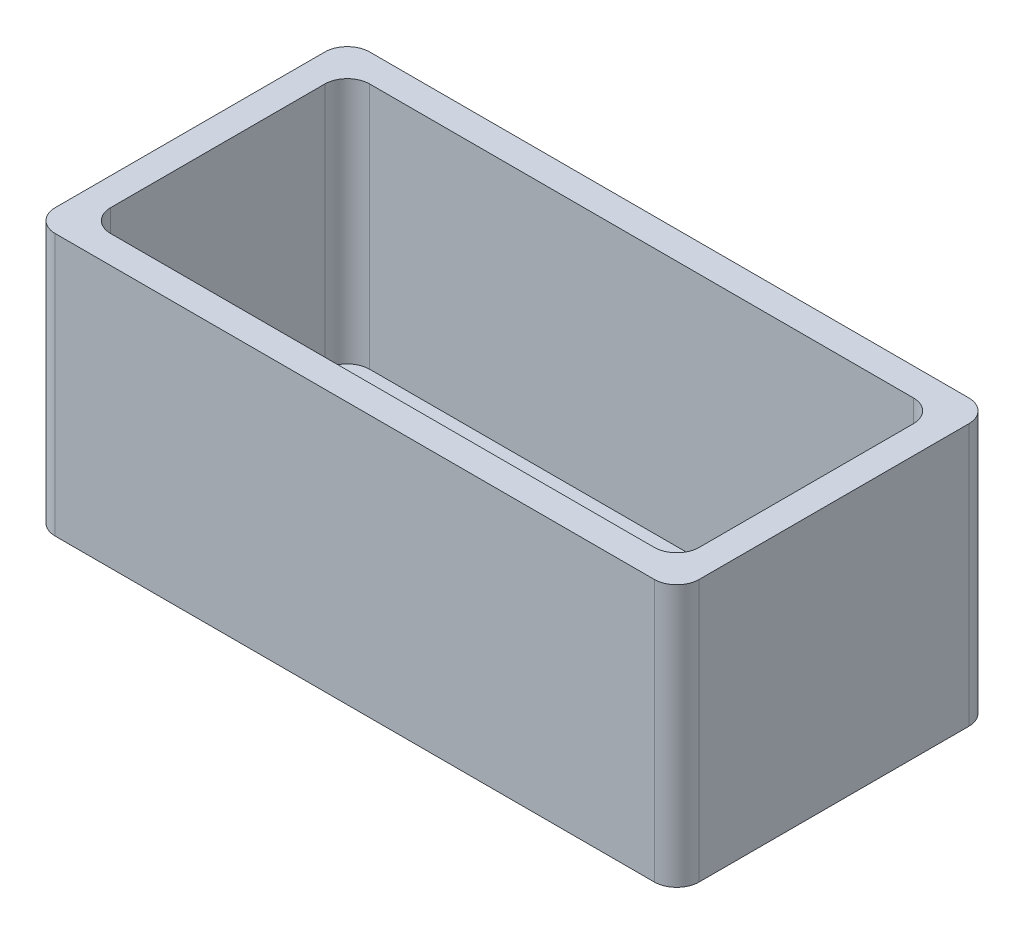
ISO-10303-21;
HEADER;
FILE_DESCRIPTION(('STEP AP214'),'2;1');
FILE_NAME('part.step','',(''),(''),'','','');
FILE_SCHEMA(('AUTOMOTIVE_DESIGN { 1 0 10303 214 1 1 1 1 }'));
ENDSEC;
DATA;
#1=APPLICATION_CONTEXT('core data for automotive mechanical design processes');
#2=APPLICATION_PROTOCOL_DEFINITION('international standard','automotive_design',2000,#1);
#3=PRODUCT_CONTEXT('',#1,'mechanical');
#4=PRODUCT('Part','Part','',(#3));
#5=PRODUCT_RELATED_PRODUCT_CATEGORY('part','',(#4));
#6=PRODUCT_DEFINITION_FORMATION('','',#4);
#7=PRODUCT_DEFINITION_CONTEXT('part definition',#1,'design');
#8=PRODUCT_DEFINITION('design','',#6,#7);
#9=PRODUCT_DEFINITION_SHAPE('','',#8);
#10=(LENGTH_UNIT() NAMED_UNIT(*) SI_UNIT(.MILLI.,.METRE.));
#11=(NAMED_UNIT(*) PLANE_ANGLE_UNIT() SI_UNIT($,.RADIAN.));
#12=(NAMED_UNIT(*) SI_UNIT($,.STERADIAN.) SOLID_ANGLE_UNIT());
#13=UNCERTAINTY_MEASURE_WITH_UNIT(LENGTH_MEASURE(1.E-05),#10,'distance_accuracy_value','');
#14=(GEOMETRIC_REPRESENTATION_CONTEXT(3) GLOBAL_UNCERTAINTY_ASSIGNED_CONTEXT((#13)) GLOBAL_UNIT_ASSIGNED_CONTEXT((#10,
#11,#12)) REPRESENTATION_CONTEXT('',''));
#15=CARTESIAN_POINT('',(0.,0.,0.));
#16=DIRECTION('',(0.,0.,1.));
#17=DIRECTION('',(1.,0.,0.));
#18=AXIS2_PLACEMENT_3D('',#15,#16,#17);
#19=CARTESIAN_POINT('',(0.,35.,0.));
#20=DIRECTION('',(0.,-1.,0.));
#21=DIRECTION('',(0.,0.,-1.));
#22=AXIS2_PLACEMENT_3D('',#19,#20,#21);
#23=PLANE('',#22);
#24=CARTESIAN_POINT('',(79.3,35.,-6.7));
#25=DIRECTION('',(0.,1.,0.));
#26=DIRECTION('',(0.,0.,1.));
#27=AXIS2_PLACEMENT_3D('',#24,#25,#26);
#28=CIRCLE('',#27,3.);
#29=CARTESIAN_POINT('',(79.3,35.,-3.7));
#30=VERTEX_POINT('',#29);
#31=CARTESIAN_POINT('',(82.3,35.,-6.7));
#32=VERTEX_POINT('',#31);
#33=EDGE_CURVE('E379',#30,#32,#28,.T.);
#34=ORIENTED_EDGE('',*,*,#33,.F.);
#35=DIRECTION('',(1.,0.,0.));
#36=VECTOR('',#35,1.);
#37=CARTESIAN_POINT('',(6.70000000000002,35.,-3.7));
#38=LINE('',#37,#36);
#39=CARTESIAN_POINT('',(6.70000000000002,35.,-3.7));
#40=VERTEX_POINT('',#39);
#41=EDGE_CURVE('E168',#40,#30,#38,.T.);
#42=ORIENTED_EDGE('',*,*,#41,.F.);
#43=CARTESIAN_POINT('',(6.7,35.,-6.7));
#44=DIRECTION('',(0.,1.,0.));
#45=DIRECTION('',(0.,0.,-1.));
#46=AXIS2_PLACEMENT_3D('',#43,#44,#45);
#47=CIRCLE('',#46,3.);
#48=CARTESIAN_POINT('',(3.7,35.,-6.70000000000002));
#49=VERTEX_POINT('',#48);
#50=EDGE_CURVE('E180',#49,#40,#47,.T.);
#51=ORIENTED_EDGE('',*,*,#50,.F.);
#52=DIRECTION('',(0.,0.,1.));
#53=VECTOR('',#52,1.);
#54=CARTESIAN_POINT('',(3.7,35.,-35.3));
#55=LINE('',#54,#53);
#56=CARTESIAN_POINT('',(3.7,35.,-35.3));
#57=VERTEX_POINT('',#56);
#58=EDGE_CURVE('E51',#57,#49,#55,.T.);
#59=ORIENTED_EDGE('',*,*,#58,.F.);
#60=CARTESIAN_POINT('',(6.7,35.,-35.3));
#61=DIRECTION('',(0.,1.,0.));
#62=DIRECTION('',(0.,0.,1.));
#63=AXIS2_PLACEMENT_3D('',#60,#61,#62);
#64=CIRCLE('',#63,3.);
#65=CARTESIAN_POINT('',(6.70000000000002,35.,-38.3));
#66=VERTEX_POINT('',#65);
#67=EDGE_CURVE('E176',#66,#57,#64,.T.);
#68=ORIENTED_EDGE('',*,*,#67,.F.);
#69=DIRECTION('',(-1.,0.,0.));
#70=VECTOR('',#69,1.);
#71=CARTESIAN_POINT('',(79.3,35.,-38.3));
#72=LINE('',#71,#70);
#73=CARTESIAN_POINT('',(79.3,35.,-38.3));
#74=VERTEX_POINT('',#73);
#75=EDGE_CURVE('E388',#74,#66,#72,.T.);
#76=ORIENTED_EDGE('',*,*,#75,.F.);
#77=CARTESIAN_POINT('',(79.3,35.,-35.3));
#78=DIRECTION('',(0.,1.,0.));
#79=DIRECTION('',(0.,0.,1.));
#80=AXIS2_PLACEMENT_3D('',#77,#78,#79);
#81=CIRCLE('',#80,3.);
#82=CARTESIAN_POINT('',(82.3,35.,-35.3));
#83=VERTEX_POINT('',#82);
#84=EDGE_CURVE('E385',#83,#74,#81,.T.);
#85=ORIENTED_EDGE('',*,*,#84,.F.);
#86=DIRECTION('',(0.,0.,-1.));
#87=VECTOR('',#86,1.);
#88=CARTESIAN_POINT('',(82.3,35.,-6.7));
#89=LINE('',#88,#87);
#90=EDGE_CURVE('E380',#32,#83,#89,.T.);
#91=ORIENTED_EDGE('',*,*,#90,.F.);
#92=EDGE_LOOP('',(#34,#42,#51,#59,#68,#76,#85,#91));
#93=FACE_BOUND('',#92,.T.);
#94=DIRECTION('',(1.,0.,0.));
#95=VECTOR('',#94,1.);
#96=CARTESIAN_POINT('',(0.,35.,0.));
#97=LINE('',#96,#95);
#98=CARTESIAN_POINT('',(3.,35.,0.));
#99=VERTEX_POINT('',#98);
#100=CARTESIAN_POINT('',(83.,35.,0.));
#101=VERTEX_POINT('',#100);
#102=EDGE_CURVE('E222',#99,#101,#97,.T.);
#103=ORIENTED_EDGE('',*,*,#102,.T.);
#104=CARTESIAN_POINT('',(83.,35.,-3.));
#105=DIRECTION('',(0.,-1.,0.));
#106=DIRECTION('',(0.,0.,-1.));
#107=AXIS2_PLACEMENT_3D('',#104,#105,#106);
#108=CIRCLE('',#107,3.);
#109=CARTESIAN_POINT('',(86.,35.,-3.));
#110=VERTEX_POINT('',#109);
#111=EDGE_CURVE('E264',#101,#110,#108,.F.);
#112=ORIENTED_EDGE('',*,*,#111,.T.);
#113=DIRECTION('',(0.,0.,-1.));
#114=VECTOR('',#113,1.);
#115=CARTESIAN_POINT('',(86.,35.,0.));
#116=LINE('',#115,#114);
#117=CARTESIAN_POINT('',(86.,35.,-39.));
#118=VERTEX_POINT('',#117);
#119=EDGE_CURVE('E226',#110,#118,#116,.T.);
#120=ORIENTED_EDGE('',*,*,#119,.T.);
#121=CARTESIAN_POINT('',(83.,35.,-39.));
#122=DIRECTION('',(0.,-1.,0.));
#123=DIRECTION('',(0.,0.,-1.));
#124=AXIS2_PLACEMENT_3D('',#121,#122,#123);
#125=CIRCLE('',#124,3.);
#126=CARTESIAN_POINT('',(83.,35.,-42.));
#127=VERTEX_POINT('',#126);
#128=EDGE_CURVE('E262',#118,#127,#125,.F.);
#129=ORIENTED_EDGE('',*,*,#128,.T.);
#130=DIRECTION('',(-1.,0.,0.));
#131=VECTOR('',#130,1.);
#132=CARTESIAN_POINT('',(0.,35.,-42.));
#133=LINE('',#132,#131);
#134=CARTESIAN_POINT('',(3.,35.,-42.));
#135=VERTEX_POINT('',#134);
#136=EDGE_CURVE('E229',#127,#135,#133,.T.);
#137=ORIENTED_EDGE('',*,*,#136,.T.);
#138=CARTESIAN_POINT('',(3.,35.,-39.));
#139=DIRECTION('',(0.,-1.,0.));
#140=DIRECTION('',(0.,0.,-1.));
#141=AXIS2_PLACEMENT_3D('',#138,#139,#140);
#142=CIRCLE('',#141,3.);
#143=CARTESIAN_POINT('',(0.,35.,-39.));
#144=VERTEX_POINT('',#143);
#145=EDGE_CURVE('E260',#135,#144,#142,.F.);
#146=ORIENTED_EDGE('',*,*,#145,.T.);
#147=DIRECTION('',(0.,0.,1.));
#148=VECTOR('',#147,1.);
#149=CARTESIAN_POINT('',(0.,35.,0.));
#150=LINE('',#149,#148);
#151=CARTESIAN_POINT('',(0.,35.,-3.));
#152=VERTEX_POINT('',#151);
#153=EDGE_CURVE('E219',#144,#152,#150,.T.);
#154=ORIENTED_EDGE('',*,*,#153,.T.);
#155=CARTESIAN_POINT('',(3.,35.,-3.));
#156=DIRECTION('',(0.,-1.,0.));
#157=DIRECTION('',(0.,0.,-1.));
#158=AXIS2_PLACEMENT_3D('',#155,#156,#157);
#159=CIRCLE('',#158,3.);
#160=EDGE_CURVE('E258',#152,#99,#159,.F.);
#161=ORIENTED_EDGE('',*,*,#160,.T.);
#162=EDGE_LOOP('',(#103,#112,#120,#129,#137,#146,#154,#161));
#163=FACE_BOUND('',#162,.T.);
#164=ADVANCED_FACE('F35',(#93,#163),#23,.F.);
#165=CARTESIAN_POINT('',(0.,0.,0.));
#166=DIRECTION('',(0.,-1.,0.));
#167=DIRECTION('',(0.,0.,-1.));
#168=AXIS2_PLACEMENT_3D('',#165,#166,#167);
#169=PLANE('',#168);
#170=CARTESIAN_POINT('',(8.99999999999999,0.,-10.));
#171=DIRECTION('',(0.,1.,0.));
#172=DIRECTION('',(0.,0.,1.));
#173=AXIS2_PLACEMENT_3D('',#170,#171,#172);
#174=CIRCLE('',#173,1.5);
#175=CARTESIAN_POINT('',(8.99999999999999,0.,-8.5));
#176=VERTEX_POINT('',#175);
#177=EDGE_CURVE('E215',#176,#176,#174,.T.);
#178=ORIENTED_EDGE('',*,*,#177,.T.);
#179=EDGE_LOOP('',(#178));
#180=FACE_BOUND('',#179,.T.);
#181=DIRECTION('',(0.,0.,-1.));
#182=VECTOR('',#181,1.);
#183=CARTESIAN_POINT('',(86.,0.,0.));
#184=LINE('',#183,#182);
#185=CARTESIAN_POINT('',(86.,0.,-3.));
#186=VERTEX_POINT('',#185);
#187=CARTESIAN_POINT('',(86.,0.,-39.));
#188=VERTEX_POINT('',#187);
#189=EDGE_CURVE('E237',#186,#188,#184,.T.);
#190=ORIENTED_EDGE('',*,*,#189,.F.);
#191=CARTESIAN_POINT('',(83.,0.,-3.));
#192=DIRECTION('',(0.,-1.,0.));
#193=DIRECTION('',(0.,0.,-1.));
#194=AXIS2_PLACEMENT_3D('',#191,#192,#193);
#195=CIRCLE('',#194,3.);
#196=CARTESIAN_POINT('',(83.,0.,0.));
#197=VERTEX_POINT('',#196);
#198=EDGE_CURVE('E251',#186,#197,#195,.T.);
#199=ORIENTED_EDGE('',*,*,#198,.T.);
#200=DIRECTION('',(1.,0.,0.));
#201=VECTOR('',#200,1.);
#202=CARTESIAN_POINT('',(0.,0.,0.));
#203=LINE('',#202,#201);
#204=CARTESIAN_POINT('',(3.,0.,0.));
#205=VERTEX_POINT('',#204);
#206=EDGE_CURVE('E234',#205,#197,#203,.T.);
#207=ORIENTED_EDGE('',*,*,#206,.F.);
#208=CARTESIAN_POINT('',(3.,0.,-3.));
#209=DIRECTION('',(0.,-1.,0.));
#210=DIRECTION('',(0.,0.,-1.));
#211=AXIS2_PLACEMENT_3D('',#208,#209,#210);
#212=CIRCLE('',#211,3.);
#213=CARTESIAN_POINT('',(0.,0.,-3.));
#214=VERTEX_POINT('',#213);
#215=EDGE_CURVE('E245',#205,#214,#212,.T.);
#216=ORIENTED_EDGE('',*,*,#215,.T.);
#217=DIRECTION('',(0.,0.,1.));
#218=VECTOR('',#217,1.);
#219=CARTESIAN_POINT('',(0.,0.,0.));
#220=LINE('',#219,#218);
#221=CARTESIAN_POINT('',(0.,0.,-39.));
#222=VERTEX_POINT('',#221);
#223=EDGE_CURVE('E218',#222,#214,#220,.T.);
#224=ORIENTED_EDGE('',*,*,#223,.F.);
#225=CARTESIAN_POINT('',(3.,0.,-39.));
#226=DIRECTION('',(0.,-1.,0.));
#227=DIRECTION('',(0.,0.,-1.));
#228=AXIS2_PLACEMENT_3D('',#225,#226,#227);
#229=CIRCLE('',#228,3.);
#230=CARTESIAN_POINT('',(3.,0.,-42.));
#231=VERTEX_POINT('',#230);
#232=EDGE_CURVE('E247',#222,#231,#229,.T.);
#233=ORIENTED_EDGE('',*,*,#232,.T.);
#234=DIRECTION('',(-1.,0.,0.));
#235=VECTOR('',#234,1.);
#236=CARTESIAN_POINT('',(0.,0.,-42.));
#237=LINE('',#236,#235);
#238=CARTESIAN_POINT('',(83.,0.,-42.));
#239=VERTEX_POINT('',#238);
#240=EDGE_CURVE('E223',#239,#231,#237,.T.);
#241=ORIENTED_EDGE('',*,*,#240,.F.);
#242=CARTESIAN_POINT('',(83.,0.,-39.));
#243=DIRECTION('',(0.,-1.,0.));
#244=DIRECTION('',(0.,0.,-1.));
#245=AXIS2_PLACEMENT_3D('',#242,#243,#244);
#246=CIRCLE('',#245,3.);
#247=EDGE_CURVE('E249',#239,#188,#246,.T.);
#248=ORIENTED_EDGE('',*,*,#247,.T.);
#249=EDGE_LOOP('',(#190,#199,#207,#216,#224,#233,#241,#248));
#250=FACE_BOUND('',#249,.T.);
#251=CARTESIAN_POINT('',(77.,0.,-10.));
#252=DIRECTION('',(0.,1.,0.));
#253=DIRECTION('',(0.,0.,1.));
#254=AXIS2_PLACEMENT_3D('',#251,#252,#253);
#255=CIRCLE('',#254,1.5);
#256=CARTESIAN_POINT('',(77.,0.,-8.50000000000001));
#257=VERTEX_POINT('',#256);
#258=EDGE_CURVE('E212',#257,#257,#255,.T.);
#259=ORIENTED_EDGE('',*,*,#258,.T.);
#260=EDGE_LOOP('',(#259));
#261=FACE_BOUND('',#260,.T.);
#262=ADVANCED_FACE('F288',(#180,#250,#261),#169,.T.);
#263=CARTESIAN_POINT('',(0.,35.,0.));
#264=DIRECTION('',(1.,0.,0.));
#265=DIRECTION('',(0.,0.,-1.));
#266=AXIS2_PLACEMENT_3D('',#263,#264,#265);
#267=PLANE('',#266);
#268=ORIENTED_EDGE('',*,*,#153,.F.);
#269=DIRECTION('',(0.,-1.,0.));
#270=VECTOR('',#269,1.);
#271=CARTESIAN_POINT('',(0.,35.,-39.));
#272=LINE('',#271,#270);
#273=EDGE_CURVE('E12',#144,#222,#272,.T.);
#274=ORIENTED_EDGE('',*,*,#273,.T.);
#275=ORIENTED_EDGE('',*,*,#223,.T.);
#276=DIRECTION('',(0.,-1.,0.));
#277=VECTOR('',#276,1.);
#278=CARTESIAN_POINT('',(0.,35.,-3.));
#279=LINE('',#278,#277);
#280=EDGE_CURVE('E44',#214,#152,#279,.F.);
#281=ORIENTED_EDGE('',*,*,#280,.T.);
#282=EDGE_LOOP('',(#268,#274,#275,#281));
#283=FACE_BOUND('',#282,.T.);
#284=ADVANCED_FACE('F273',(#283),#267,.F.);
#285=CARTESIAN_POINT('',(0.,35.,0.));
#286=DIRECTION('',(0.,0.,-1.));
#287=DIRECTION('',(-1.,0.,0.));
#288=AXIS2_PLACEMENT_3D('',#285,#286,#287);
#289=PLANE('',#288);
#290=ORIENTED_EDGE('',*,*,#206,.T.);
#291=DIRECTION('',(0.,-1.,0.));
#292=VECTOR('',#291,1.);
#293=CARTESIAN_POINT('',(83.,35.,0.));
#294=LINE('',#293,#292);
#295=EDGE_CURVE('E256',#197,#101,#294,.F.);
#296=ORIENTED_EDGE('',*,*,#295,.T.);
#297=ORIENTED_EDGE('',*,*,#102,.F.);
#298=DIRECTION('',(0.,-1.,0.));
#299=VECTOR('',#298,1.);
#300=CARTESIAN_POINT('',(3.,35.,0.));
#301=LINE('',#300,#299);
#302=EDGE_CURVE('E253',#99,#205,#301,.T.);
#303=ORIENTED_EDGE('',*,*,#302,.T.);
#304=EDGE_LOOP('',(#290,#296,#297,#303));
#305=FACE_BOUND('',#304,.T.);
#306=ADVANCED_FACE('F284',(#305),#289,.F.);
#307=CARTESIAN_POINT('',(86.,35.,0.));
#308=DIRECTION('',(-1.,0.,0.));
#309=DIRECTION('',(0.,0.,1.));
#310=AXIS2_PLACEMENT_3D('',#307,#308,#309);
#311=PLANE('',#310);
#312=ORIENTED_EDGE('',*,*,#119,.F.);
#313=DIRECTION('',(0.,-1.,0.));
#314=VECTOR('',#313,1.);
#315=CARTESIAN_POINT('',(86.,35.,-3.));
#316=LINE('',#315,#314);
#317=EDGE_CURVE('E242',#110,#186,#316,.T.);
#318=ORIENTED_EDGE('',*,*,#317,.T.);
#319=ORIENTED_EDGE('',*,*,#189,.T.);
#320=DIRECTION('',(0.,-1.,0.));
#321=VECTOR('',#320,1.);
#322=CARTESIAN_POINT('',(86.,35.,-39.));
#323=LINE('',#322,#321);
#324=EDGE_CURVE('E231',#188,#118,#323,.F.);
#325=ORIENTED_EDGE('',*,*,#324,.T.);
#326=EDGE_LOOP('',(#312,#318,#319,#325));
#327=FACE_BOUND('',#326,.T.);
#328=ADVANCED_FACE('F296',(#327),#311,.F.);
#329=CARTESIAN_POINT('',(0.,35.,-42.));
#330=DIRECTION('',(0.,0.,1.));
#331=DIRECTION('',(1.,0.,0.));
#332=AXIS2_PLACEMENT_3D('',#329,#330,#331);
#333=PLANE('',#332);
#334=ORIENTED_EDGE('',*,*,#136,.F.);
#335=DIRECTION('',(0.,-1.,0.));
#336=VECTOR('',#335,1.);
#337=CARTESIAN_POINT('',(83.,35.,-42.));
#338=LINE('',#337,#336);
#339=EDGE_CURVE('E267',#127,#239,#338,.T.);
#340=ORIENTED_EDGE('',*,*,#339,.T.);
#341=ORIENTED_EDGE('',*,*,#240,.T.);
#342=DIRECTION('',(0.,-1.,0.));
#343=VECTOR('',#342,1.);
#344=CARTESIAN_POINT('',(3.,35.,-42.));
#345=LINE('',#344,#343);
#346=EDGE_CURVE('E59',#231,#135,#345,.F.);
#347=ORIENTED_EDGE('',*,*,#346,.T.);
#348=EDGE_LOOP('',(#334,#340,#341,#347));
#349=FACE_BOUND('',#348,.T.);
#350=ADVANCED_FACE('F303',(#349),#333,.F.);
#351=CARTESIAN_POINT('',(8.99999999999999,35.,-10.));
#352=DIRECTION('',(0.,-1.,0.));
#353=DIRECTION('',(0.,0.,-1.));
#354=AXIS2_PLACEMENT_3D('',#351,#352,#353);
#355=CYLINDRICAL_SURFACE('',#354,1.5);
#356=CARTESIAN_POINT('',(8.99999999999999,2.,-10.));
#357=DIRECTION('',(0.,-1.,0.));
#358=DIRECTION('',(0.,0.,-1.));
#359=AXIS2_PLACEMENT_3D('',#356,#357,#358);
#360=CIRCLE('',#359,1.5);
#361=CARTESIAN_POINT('',(8.99999999999999,2.,-11.5));
#362=VERTEX_POINT('',#361);
#363=EDGE_CURVE('E209',#362,#362,#360,.T.);
#364=ORIENTED_EDGE('',*,*,#363,.F.);
#365=EDGE_LOOP('',(#364));
#366=FACE_BOUND('',#365,.T.);
#367=ORIENTED_EDGE('',*,*,#177,.F.);
#368=EDGE_LOOP('',(#367));
#369=FACE_BOUND('',#368,.T.);
#370=ADVANCED_FACE('F321',(#366,#369),#355,.F.);
#371=CARTESIAN_POINT('',(77.,35.,-10.));
#372=DIRECTION('',(0.,-1.,0.));
#373=DIRECTION('',(0.,0.,-1.));
#374=AXIS2_PLACEMENT_3D('',#371,#372,#373);
#375=CYLINDRICAL_SURFACE('',#374,1.5);
#376=CARTESIAN_POINT('',(77.,2.,-10.));
#377=DIRECTION('',(0.,-1.,0.));
#378=DIRECTION('',(0.,0.,-1.));
#379=AXIS2_PLACEMENT_3D('',#376,#377,#378);
#380=CIRCLE('',#379,1.5);
#381=CARTESIAN_POINT('',(77.,2.,-11.5));
#382=VERTEX_POINT('',#381);
#383=EDGE_CURVE('E39',#382,#382,#380,.T.);
#384=ORIENTED_EDGE('',*,*,#383,.F.);
#385=EDGE_LOOP('',(#384));
#386=FACE_BOUND('',#385,.T.);
#387=ORIENTED_EDGE('',*,*,#258,.F.);
#388=EDGE_LOOP('',(#387));
#389=FACE_BOUND('',#388,.T.);
#390=ADVANCED_FACE('F333',(#386,#389),#375,.F.);
#391=CARTESIAN_POINT('',(83.,35.,-3.));
#392=DIRECTION('',(0.,-1.,0.));
#393=DIRECTION('',(0.,0.,-1.));
#394=AXIS2_PLACEMENT_3D('',#391,#392,#393);
#395=CYLINDRICAL_SURFACE('',#394,3.);
#396=ORIENTED_EDGE('',*,*,#111,.F.);
#397=ORIENTED_EDGE('',*,*,#295,.F.);
#398=ORIENTED_EDGE('',*,*,#198,.F.);
#399=ORIENTED_EDGE('',*,*,#317,.F.);
#400=EDGE_LOOP('',(#396,#397,#398,#399));
#401=FACE_BOUND('',#400,.T.);
#402=ADVANCED_FACE('F293',(#401),#395,.T.);
#403=CARTESIAN_POINT('',(83.,35.,-39.));
#404=DIRECTION('',(0.,-1.,0.));
#405=DIRECTION('',(0.,0.,-1.));
#406=AXIS2_PLACEMENT_3D('',#403,#404,#405);
#407=CYLINDRICAL_SURFACE('',#406,3.);
#408=ORIENTED_EDGE('',*,*,#128,.F.);
#409=ORIENTED_EDGE('',*,*,#324,.F.);
#410=ORIENTED_EDGE('',*,*,#247,.F.);
#411=ORIENTED_EDGE('',*,*,#339,.F.);
#412=EDGE_LOOP('',(#408,#409,#410,#411));
#413=FACE_BOUND('',#412,.T.);
#414=ADVANCED_FACE('F301',(#413),#407,.T.);
#415=CARTESIAN_POINT('',(3.,35.,-39.));
#416=DIRECTION('',(0.,-1.,0.));
#417=DIRECTION('',(0.,0.,-1.));
#418=AXIS2_PLACEMENT_3D('',#415,#416,#417);
#419=CYLINDRICAL_SURFACE('',#418,3.);
#420=ORIENTED_EDGE('',*,*,#145,.F.);
#421=ORIENTED_EDGE('',*,*,#346,.F.);
#422=ORIENTED_EDGE('',*,*,#232,.F.);
#423=ORIENTED_EDGE('',*,*,#273,.F.);
#424=EDGE_LOOP('',(#420,#421,#422,#423));
#425=FACE_BOUND('',#424,.T.);
#426=ADVANCED_FACE('F305',(#425),#419,.T.);
#427=CARTESIAN_POINT('',(3.,35.,-3.));
#428=DIRECTION('',(0.,-1.,0.));
#429=DIRECTION('',(0.,0.,-1.));
#430=AXIS2_PLACEMENT_3D('',#427,#428,#429);
#431=CYLINDRICAL_SURFACE('',#430,3.);
#432=ORIENTED_EDGE('',*,*,#160,.F.);
#433=ORIENTED_EDGE('',*,*,#280,.F.);
#434=ORIENTED_EDGE('',*,*,#215,.F.);
#435=ORIENTED_EDGE('',*,*,#302,.F.);
#436=EDGE_LOOP('',(#432,#433,#434,#435));
#437=FACE_BOUND('',#436,.T.);
#438=ADVANCED_FACE('F37',(#437),#431,.T.);
#439=CARTESIAN_POINT('',(0.,2.,0.));
#440=DIRECTION('',(0.,-1.,0.));
#441=DIRECTION('',(0.,0.,-1.));
#442=AXIS2_PLACEMENT_3D('',#439,#440,#441);
#443=PLANE('',#442);
#444=ORIENTED_EDGE('',*,*,#363,.T.);
#445=EDGE_LOOP('',(#444));
#446=FACE_BOUND('',#445,.T.);
#447=ORIENTED_EDGE('',*,*,#383,.T.);
#448=EDGE_LOOP('',(#447));
#449=FACE_BOUND('',#448,.T.);
#450=CARTESIAN_POINT('',(6.7,2.,-6.7));
#451=DIRECTION('',(0.,-1.,0.));
#452=DIRECTION('',(0.,0.,-1.));
#453=AXIS2_PLACEMENT_3D('',#450,#451,#452);
#454=CIRCLE('',#453,3.);
#455=CARTESIAN_POINT('',(3.7,2.,-6.70000000000003));
#456=VERTEX_POINT('',#455);
#457=CARTESIAN_POINT('',(6.70000000000002,2.,-3.7));
#458=VERTEX_POINT('',#457);
#459=EDGE_CURVE('E173',#456,#458,#454,.F.);
#460=ORIENTED_EDGE('',*,*,#459,.T.);
#461=DIRECTION('',(1.,0.,0.));
#462=VECTOR('',#461,1.);
#463=CARTESIAN_POINT('',(6.70000000000002,2.,-3.7));
#464=LINE('',#463,#462);
#465=CARTESIAN_POINT('',(79.3,2.,-3.7));
#466=VERTEX_POINT('',#465);
#467=EDGE_CURVE('E165',#458,#466,#464,.T.);
#468=ORIENTED_EDGE('',*,*,#467,.T.);
#469=CARTESIAN_POINT('',(79.3,2.,-6.7));
#470=DIRECTION('',(0.,-1.,0.));
#471=DIRECTION('',(0.,0.,-1.));
#472=AXIS2_PLACEMENT_3D('',#469,#470,#471);
#473=CIRCLE('',#472,3.);
#474=CARTESIAN_POINT('',(82.3,2.,-6.7));
#475=VERTEX_POINT('',#474);
#476=EDGE_CURVE('E152',#466,#475,#473,.F.);
#477=ORIENTED_EDGE('',*,*,#476,.T.);
#478=DIRECTION('',(0.,0.,-1.));
#479=VECTOR('',#478,1.);
#480=CARTESIAN_POINT('',(82.3,2.,-6.7));
#481=LINE('',#480,#479);
#482=CARTESIAN_POINT('',(82.3,2.,-35.3));
#483=VERTEX_POINT('',#482);
#484=EDGE_CURVE('E200',#475,#483,#481,.T.);
#485=ORIENTED_EDGE('',*,*,#484,.T.);
#486=CARTESIAN_POINT('',(79.3,2.,-35.3));
#487=DIRECTION('',(0.,-1.,0.));
#488=DIRECTION('',(0.,0.,-1.));
#489=AXIS2_PLACEMENT_3D('',#486,#487,#488);
#490=CIRCLE('',#489,3.);
#491=CARTESIAN_POINT('',(79.3,2.,-38.3));
#492=VERTEX_POINT('',#491);
#493=EDGE_CURVE('E196',#483,#492,#490,.F.);
#494=ORIENTED_EDGE('',*,*,#493,.T.);
#495=DIRECTION('',(-1.,0.,0.));
#496=VECTOR('',#495,1.);
#497=CARTESIAN_POINT('',(79.3,2.,-38.3));
#498=LINE('',#497,#496);
#499=CARTESIAN_POINT('',(6.70000000000003,2.,-38.3));
#500=VERTEX_POINT('',#499);
#501=EDGE_CURVE('E192',#492,#500,#498,.T.);
#502=ORIENTED_EDGE('',*,*,#501,.T.);
#503=CARTESIAN_POINT('',(6.7,2.,-35.3));
#504=DIRECTION('',(0.,-1.,0.));
#505=DIRECTION('',(0.,0.,-1.));
#506=AXIS2_PLACEMENT_3D('',#503,#504,#505);
#507=CIRCLE('',#506,3.);
#508=CARTESIAN_POINT('',(3.7,2.,-35.3));
#509=VERTEX_POINT('',#508);
#510=EDGE_CURVE('E188',#500,#509,#507,.F.);
#511=ORIENTED_EDGE('',*,*,#510,.T.);
#512=DIRECTION('',(0.,0.,1.));
#513=VECTOR('',#512,1.);
#514=CARTESIAN_POINT('',(3.7,2.,-35.3));
#515=LINE('',#514,#513);
#516=EDGE_CURVE('E185',#509,#456,#515,.T.);
#517=ORIENTED_EDGE('',*,*,#516,.T.);
#518=EDGE_LOOP('',(#460,#468,#477,#485,#494,#502,#511,#517));
#519=FACE_BOUND('',#518,.T.);
#520=ADVANCED_FACE('F171',(#446,#449,#519),#443,.F.);
#521=CARTESIAN_POINT('',(6.70000000000002,-85.878518850758,-3.7));
#522=DIRECTION('',(0.,0.,1.));
#523=DIRECTION('',(1.,0.,0.));
#524=AXIS2_PLACEMENT_3D('',#521,#522,#523);
#525=PLANE('',#524);
#526=DIRECTION('',(0.,1.,0.));
#527=VECTOR('',#526,1.);
#528=CARTESIAN_POINT('',(6.70000000000002,-85.878518850758,-3.7));
#529=LINE('',#528,#527);
#530=EDGE_CURVE('E183',#458,#40,#529,.T.);
#531=ORIENTED_EDGE('',*,*,#530,.T.);
#532=ORIENTED_EDGE('',*,*,#41,.T.);
#533=DIRECTION('',(0.,1.,0.));
#534=VECTOR('',#533,1.);
#535=CARTESIAN_POINT('',(79.3,-85.878518850758,-3.7));
#536=LINE('',#535,#534);
#537=EDGE_CURVE('E156',#466,#30,#536,.T.);
#538=ORIENTED_EDGE('',*,*,#537,.F.);
#539=ORIENTED_EDGE('',*,*,#467,.F.);
#540=EDGE_LOOP('',(#531,#532,#538,#539));
#541=FACE_BOUND('',#540,.T.);
#542=ADVANCED_FACE('F164',(#541),#525,.F.);
#543=CARTESIAN_POINT('',(79.3,-85.878518850758,-6.7));
#544=DIRECTION('',(0.,1.,0.));
#545=DIRECTION('',(0.,0.,1.));
#546=AXIS2_PLACEMENT_3D('',#543,#544,#545);
#547=CYLINDRICAL_SURFACE('',#546,3.);
#548=ORIENTED_EDGE('',*,*,#537,.T.);
#549=ORIENTED_EDGE('',*,*,#33,.T.);
#550=DIRECTION('',(0.,1.,0.));
#551=VECTOR('',#550,1.);
#552=CARTESIAN_POINT('',(82.3,-85.878518850758,-6.7));
#553=LINE('',#552,#551);
#554=EDGE_CURVE('E158',#475,#32,#553,.T.);
#555=ORIENTED_EDGE('',*,*,#554,.F.);
#556=ORIENTED_EDGE('',*,*,#476,.F.);
#557=EDGE_LOOP('',(#548,#549,#555,#556));
#558=FACE_BOUND('',#557,.T.);
#559=ADVANCED_FACE('F154',(#558),#547,.F.);
#560=CARTESIAN_POINT('',(82.3,-85.878518850758,-6.7));
#561=DIRECTION('',(1.,0.,0.));
#562=DIRECTION('',(0.,0.,-1.));
#563=AXIS2_PLACEMENT_3D('',#560,#561,#562);
#564=PLANE('',#563);
#565=ORIENTED_EDGE('',*,*,#554,.T.);
#566=ORIENTED_EDGE('',*,*,#90,.T.);
#567=DIRECTION('',(0.,1.,0.));
#568=VECTOR('',#567,1.);
#569=CARTESIAN_POINT('',(82.3,-85.878518850758,-35.3));
#570=LINE('',#569,#568);
#571=EDGE_CURVE('E199',#483,#83,#570,.T.);
#572=ORIENTED_EDGE('',*,*,#571,.F.);
#573=ORIENTED_EDGE('',*,*,#484,.F.);
#574=EDGE_LOOP('',(#565,#566,#572,#573));
#575=FACE_BOUND('',#574,.T.);
#576=ADVANCED_FACE('F352',(#575),#564,.F.);
#577=CARTESIAN_POINT('',(79.3,-85.878518850758,-35.3));
#578=DIRECTION('',(0.,1.,0.));
#579=DIRECTION('',(0.,0.,1.));
#580=AXIS2_PLACEMENT_3D('',#577,#578,#579);
#581=CYLINDRICAL_SURFACE('',#580,3.);
#582=ORIENTED_EDGE('',*,*,#571,.T.);
#583=ORIENTED_EDGE('',*,*,#84,.T.);
#584=DIRECTION('',(0.,1.,0.));
#585=VECTOR('',#584,1.);
#586=CARTESIAN_POINT('',(79.3,-85.878518850758,-38.3));
#587=LINE('',#586,#585);
#588=EDGE_CURVE('E195',#492,#74,#587,.T.);
#589=ORIENTED_EDGE('',*,*,#588,.F.);
#590=ORIENTED_EDGE('',*,*,#493,.F.);
#591=EDGE_LOOP('',(#582,#583,#589,#590));
#592=FACE_BOUND('',#591,.T.);
#593=ADVANCED_FACE('F355',(#592),#581,.F.);
#594=CARTESIAN_POINT('',(79.3,-85.878518850758,-38.3));
#595=DIRECTION('',(0.,0.,-1.));
#596=DIRECTION('',(-1.,0.,0.));
#597=AXIS2_PLACEMENT_3D('',#594,#595,#596);
#598=PLANE('',#597);
#599=ORIENTED_EDGE('',*,*,#588,.T.);
#600=ORIENTED_EDGE('',*,*,#75,.T.);
#601=DIRECTION('',(0.,1.,0.));
#602=VECTOR('',#601,1.);
#603=CARTESIAN_POINT('',(6.70000000000002,-85.878518850758,-38.3));
#604=LINE('',#603,#602);
#605=EDGE_CURVE('E191',#500,#66,#604,.T.);
#606=ORIENTED_EDGE('',*,*,#605,.F.);
#607=ORIENTED_EDGE('',*,*,#501,.F.);
#608=EDGE_LOOP('',(#599,#600,#606,#607));
#609=FACE_BOUND('',#608,.T.);
#610=ADVANCED_FACE('F359',(#609),#598,.F.);
#611=CARTESIAN_POINT('',(6.7,-85.878518850758,-35.3));
#612=DIRECTION('',(0.,1.,0.));
#613=DIRECTION('',(0.,0.,1.));
#614=AXIS2_PLACEMENT_3D('',#611,#612,#613);
#615=CYLINDRICAL_SURFACE('',#614,3.);
#616=ORIENTED_EDGE('',*,*,#605,.T.);
#617=ORIENTED_EDGE('',*,*,#67,.T.);
#618=DIRECTION('',(0.,1.,0.));
#619=VECTOR('',#618,1.);
#620=CARTESIAN_POINT('',(3.7,-85.878518850758,-35.3));
#621=LINE('',#620,#619);
#622=EDGE_CURVE('E187',#509,#57,#621,.T.);
#623=ORIENTED_EDGE('',*,*,#622,.F.);
#624=ORIENTED_EDGE('',*,*,#510,.F.);
#625=EDGE_LOOP('',(#616,#617,#623,#624));
#626=FACE_BOUND('',#625,.T.);
#627=ADVANCED_FACE('F363',(#626),#615,.F.);
#628=CARTESIAN_POINT('',(3.7,-85.878518850758,-35.3));
#629=DIRECTION('',(-1.,0.,0.));
#630=DIRECTION('',(0.,0.,1.));
#631=AXIS2_PLACEMENT_3D('',#628,#629,#630);
#632=PLANE('',#631);
#633=ORIENTED_EDGE('',*,*,#622,.T.);
#634=ORIENTED_EDGE('',*,*,#58,.T.);
#635=DIRECTION('',(0.,1.,0.));
#636=VECTOR('',#635,1.);
#637=CARTESIAN_POINT('',(3.7,-85.878518850758,-6.70000000000002));
#638=LINE('',#637,#636);
#639=EDGE_CURVE('E184',#456,#49,#638,.T.);
#640=ORIENTED_EDGE('',*,*,#639,.F.);
#641=ORIENTED_EDGE('',*,*,#516,.F.);
#642=EDGE_LOOP('',(#633,#634,#640,#641));
#643=FACE_BOUND('',#642,.T.);
#644=ADVANCED_FACE('F367',(#643),#632,.F.);
#645=CARTESIAN_POINT('',(6.7,-85.878518850758,-6.7));
#646=DIRECTION('',(0.,1.,0.));
#647=DIRECTION('',(0.,0.,1.));
#648=AXIS2_PLACEMENT_3D('',#645,#646,#647);
#649=CYLINDRICAL_SURFACE('',#648,3.);
#650=ORIENTED_EDGE('',*,*,#639,.T.);
#651=ORIENTED_EDGE('',*,*,#50,.T.);
#652=ORIENTED_EDGE('',*,*,#530,.F.);
#653=ORIENTED_EDGE('',*,*,#459,.F.);
#654=EDGE_LOOP('',(#650,#651,#652,#653));
#655=FACE_BOUND('',#654,.T.);
#656=ADVANCED_FACE('F371',(#655),#649,.F.);
#657=CLOSED_SHELL('',(#164,#262,#284,#306,#328,#350,#370,#390,#402,#414,#426,#438,#520,#542,
#559,#576,#593,#610,#627,#644,#656));
#658=MANIFOLD_SOLID_BREP('B2',#657);
#659=ADVANCED_BREP_SHAPE_REPRESENTATION('',(#18,#658),#14);
#660=SHAPE_DEFINITION_REPRESENTATION(#9,#659);
ENDSEC;
END-ISO-10303-21;
